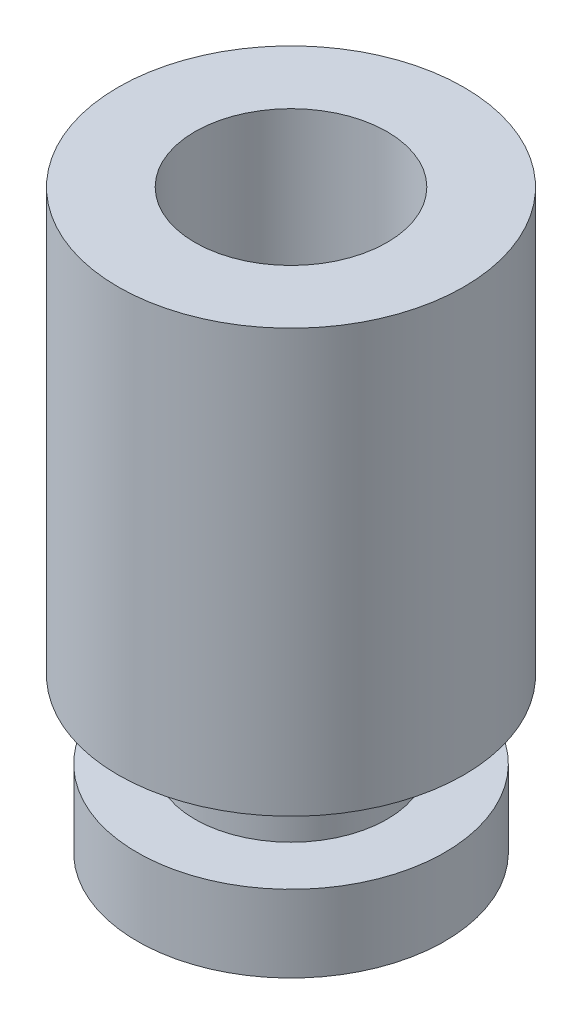
ISO-10303-21;
HEADER;
FILE_DESCRIPTION(('STEP AP214'),'2;1');
FILE_NAME('part.step','',(''),(''),'','','');
FILE_SCHEMA(('AUTOMOTIVE_DESIGN { 1 0 10303 214 1 1 1 1 }'));
ENDSEC;
DATA;
#1=APPLICATION_CONTEXT('core data for automotive mechanical design processes');
#2=APPLICATION_PROTOCOL_DEFINITION('international standard','automotive_design',2000,#1);
#3=PRODUCT_CONTEXT('',#1,'mechanical');
#4=PRODUCT('Part','Part','',(#3));
#5=PRODUCT_RELATED_PRODUCT_CATEGORY('part','',(#4));
#6=PRODUCT_DEFINITION_FORMATION('','',#4);
#7=PRODUCT_DEFINITION_CONTEXT('part definition',#1,'design');
#8=PRODUCT_DEFINITION('design','',#6,#7);
#9=PRODUCT_DEFINITION_SHAPE('','',#8);
#10=(LENGTH_UNIT() NAMED_UNIT(*) SI_UNIT(.MILLI.,.METRE.));
#11=(NAMED_UNIT(*) PLANE_ANGLE_UNIT() SI_UNIT($,.RADIAN.));
#12=(NAMED_UNIT(*) SI_UNIT($,.STERADIAN.) SOLID_ANGLE_UNIT());
#13=UNCERTAINTY_MEASURE_WITH_UNIT(LENGTH_MEASURE(1.E-05),#10,'distance_accuracy_value','');
#14=(GEOMETRIC_REPRESENTATION_CONTEXT(3) GLOBAL_UNCERTAINTY_ASSIGNED_CONTEXT((#13)) GLOBAL_UNIT_ASSIGNED_CONTEXT((#10,
#11,#12)) REPRESENTATION_CONTEXT('',''));
#15=CARTESIAN_POINT('',(0.,0.,0.));
#16=DIRECTION('',(0.,0.,1.));
#17=DIRECTION('',(1.,0.,0.));
#18=AXIS2_PLACEMENT_3D('',#15,#16,#17);
#19=CARTESIAN_POINT('',(-0.522013311509166,5.5,-0.51113803418606));
#20=DIRECTION('',(0.,-1.,0.));
#21=DIRECTION('',(0.,0.,-1.));
#22=AXIS2_PLACEMENT_3D('',#19,#20,#21);
#23=CYLINDRICAL_SURFACE('',#22,2.25);
#24=CARTESIAN_POINT('',(-0.522013311509166,5.5,-0.51113803418606));
#25=DIRECTION('',(0.,1.,0.));
#26=DIRECTION('',(0.,0.,1.));
#27=AXIS2_PLACEMENT_3D('',#24,#25,#26);
#28=CIRCLE('',#27,2.25);
#29=CARTESIAN_POINT('',(-0.522013311509166,5.5,1.73886196581394));
#30=VERTEX_POINT('',#29);
#31=EDGE_CURVE('E53',#30,#30,#28,.T.);
#32=ORIENTED_EDGE('',*,*,#31,.F.);
#33=EDGE_LOOP('',(#32));
#34=FACE_BOUND('',#33,.T.);
#35=CARTESIAN_POINT('',(-0.522013311509166,0.,-0.51113803418606));
#36=DIRECTION('',(0.,1.,0.));
#37=DIRECTION('',(0.,0.,1.));
#38=AXIS2_PLACEMENT_3D('',#35,#36,#37);
#39=CIRCLE('',#38,2.25);
#40=CARTESIAN_POINT('',(-0.522013311509166,0.,1.73886196581394));
#41=VERTEX_POINT('',#40);
#42=EDGE_CURVE('E48',#41,#41,#39,.T.);
#43=ORIENTED_EDGE('',*,*,#42,.T.);
#44=EDGE_LOOP('',(#43));
#45=FACE_BOUND('',#44,.T.);
#46=ADVANCED_FACE('F45',(#34,#45),#23,.T.);
#47=CARTESIAN_POINT('',(-0.522013311509166,5.5,-0.51113803418606));
#48=DIRECTION('',(0.,1.,0.));
#49=DIRECTION('',(0.,0.,1.));
#50=AXIS2_PLACEMENT_3D('',#47,#48,#49);
#51=PLANE('',#50);
#52=CARTESIAN_POINT('',(-0.522013311509166,5.5,-0.51113803418606));
#53=DIRECTION('',(0.,1.,0.));
#54=DIRECTION('',(0.,0.,1.));
#55=AXIS2_PLACEMENT_3D('',#52,#53,#54);
#56=CIRCLE('',#55,1.25);
#57=CARTESIAN_POINT('',(-0.522013311509166,5.5,0.73886196581394));
#58=VERTEX_POINT('',#57);
#59=EDGE_CURVE('E73',#58,#58,#56,.T.);
#60=ORIENTED_EDGE('',*,*,#59,.F.);
#61=EDGE_LOOP('',(#60));
#62=FACE_BOUND('',#61,.T.);
#63=ORIENTED_EDGE('',*,*,#31,.T.);
#64=EDGE_LOOP('',(#63));
#65=FACE_BOUND('',#64,.T.);
#66=ADVANCED_FACE('F90',(#62,#65),#51,.T.);
#67=CARTESIAN_POINT('',(-0.522013311509166,0.,-0.51113803418606));
#68=DIRECTION('',(0.,1.,0.));
#69=DIRECTION('',(0.,0.,1.));
#70=AXIS2_PLACEMENT_3D('',#67,#68,#69);
#71=PLANE('',#70);
#72=CARTESIAN_POINT('',(-0.522013311509166,0.,-0.51113803418606));
#73=DIRECTION('',(0.,-1.,0.));
#74=DIRECTION('',(0.,0.,-1.));
#75=AXIS2_PLACEMENT_3D('',#72,#73,#74);
#76=CIRCLE('',#75,1.25);
#77=CARTESIAN_POINT('',(-0.522013311509166,0.,-1.76113803418606));
#78=VERTEX_POINT('',#77);
#79=EDGE_CURVE('E10',#78,#78,#76,.T.);
#80=ORIENTED_EDGE('',*,*,#79,.F.);
#81=EDGE_LOOP('',(#80));
#82=FACE_BOUND('',#81,.T.);
#83=ORIENTED_EDGE('',*,*,#42,.F.);
#84=EDGE_LOOP('',(#83));
#85=FACE_BOUND('',#84,.T.);
#86=ADVANCED_FACE('F93',(#82,#85),#71,.F.);
#87=CARTESIAN_POINT('',(-0.522013311509166,-1.,-0.51113803418606));
#88=DIRECTION('',(0.,1.,0.));
#89=DIRECTION('',(0.,0.,1.));
#90=AXIS2_PLACEMENT_3D('',#87,#88,#89);
#91=CYLINDRICAL_SURFACE('',#90,1.25);
#92=CARTESIAN_POINT('',(-0.522013311509166,-1.,-0.51113803418606));
#93=DIRECTION('',(0.,-1.,0.));
#94=DIRECTION('',(0.,0.,-1.));
#95=AXIS2_PLACEMENT_3D('',#92,#93,#94);
#96=CIRCLE('',#95,1.25);
#97=CARTESIAN_POINT('',(-0.522013311509166,-1.,-1.76113803418606));
#98=VERTEX_POINT('',#97);
#99=EDGE_CURVE('E60',#98,#98,#96,.T.);
#100=ORIENTED_EDGE('',*,*,#99,.F.);
#101=EDGE_LOOP('',(#100));
#102=FACE_BOUND('',#101,.T.);
#103=ORIENTED_EDGE('',*,*,#79,.T.);
#104=EDGE_LOOP('',(#103));
#105=FACE_BOUND('',#104,.T.);
#106=ADVANCED_FACE('F104',(#102,#105),#91,.T.);
#107=CARTESIAN_POINT('',(-0.522013311509166,-2.,-0.51113803418606));
#108=DIRECTION('',(0.,1.,0.));
#109=DIRECTION('',(0.,0.,1.));
#110=AXIS2_PLACEMENT_3D('',#107,#108,#109);
#111=CYLINDRICAL_SURFACE('',#110,2.);
#112=CARTESIAN_POINT('',(-0.522013311509166,-2.,-0.51113803418606));
#113=DIRECTION('',(0.,-1.,0.));
#114=DIRECTION('',(0.,0.,-1.));
#115=AXIS2_PLACEMENT_3D('',#112,#113,#114);
#116=CIRCLE('',#115,2.);
#117=CARTESIAN_POINT('',(-0.522013311509166,-2.,-2.51113803418606));
#118=VERTEX_POINT('',#117);
#119=EDGE_CURVE('E64',#118,#118,#116,.T.);
#120=ORIENTED_EDGE('',*,*,#119,.F.);
#121=EDGE_LOOP('',(#120));
#122=FACE_BOUND('',#121,.T.);
#123=CARTESIAN_POINT('',(-0.522013311509166,-1.,-0.51113803418606));
#124=DIRECTION('',(0.,-1.,0.));
#125=DIRECTION('',(0.,0.,-1.));
#126=AXIS2_PLACEMENT_3D('',#123,#124,#125);
#127=CIRCLE('',#126,2.);
#128=CARTESIAN_POINT('',(-0.522013311509166,-1.,-2.51113803418606));
#129=VERTEX_POINT('',#128);
#130=EDGE_CURVE('E65',#129,#129,#127,.T.);
#131=ORIENTED_EDGE('',*,*,#130,.T.);
#132=EDGE_LOOP('',(#131));
#133=FACE_BOUND('',#132,.T.);
#134=ADVANCED_FACE('F109',(#122,#133),#111,.T.);
#135=CARTESIAN_POINT('',(-0.522013311509166,-2.,-0.51113803418606));
#136=DIRECTION('',(0.,-1.,0.));
#137=DIRECTION('',(0.,0.,-1.));
#138=AXIS2_PLACEMENT_3D('',#135,#136,#137);
#139=PLANE('',#138);
#140=ORIENTED_EDGE('',*,*,#119,.T.);
#141=EDGE_LOOP('',(#140));
#142=FACE_BOUND('',#141,.T.);
#143=ADVANCED_FACE('F115',(#142),#139,.T.);
#144=CARTESIAN_POINT('',(-0.522013311509166,-1.,-0.51113803418606));
#145=DIRECTION('',(0.,-1.,0.));
#146=DIRECTION('',(0.,0.,-1.));
#147=AXIS2_PLACEMENT_3D('',#144,#145,#146);
#148=PLANE('',#147);
#149=ORIENTED_EDGE('',*,*,#99,.T.);
#150=EDGE_LOOP('',(#149));
#151=FACE_BOUND('',#150,.T.);
#152=ORIENTED_EDGE('',*,*,#130,.F.);
#153=EDGE_LOOP('',(#152));
#154=FACE_BOUND('',#153,.T.);
#155=ADVANCED_FACE('F86',(#151,#154),#148,.F.);
#156=CARTESIAN_POINT('',(-0.522013311509166,0.5,-0.51113803418606));
#157=DIRECTION('',(0.,1.,0.));
#158=DIRECTION('',(0.,0.,1.));
#159=AXIS2_PLACEMENT_3D('',#156,#157,#158);
#160=CYLINDRICAL_SURFACE('',#159,1.25);
#161=CARTESIAN_POINT('',(-0.522013311509166,0.5,-0.51113803418606));
#162=DIRECTION('',(0.,1.,0.));
#163=DIRECTION('',(0.,0.,1.));
#164=AXIS2_PLACEMENT_3D('',#161,#162,#163);
#165=CIRCLE('',#164,1.25);
#166=CARTESIAN_POINT('',(-0.522013311509166,0.5,0.73886196581394));
#167=VERTEX_POINT('',#166);
#168=EDGE_CURVE('E69',#167,#167,#165,.T.);
#169=ORIENTED_EDGE('',*,*,#168,.F.);
#170=EDGE_LOOP('',(#169));
#171=FACE_BOUND('',#170,.T.);
#172=ORIENTED_EDGE('',*,*,#59,.T.);
#173=EDGE_LOOP('',(#172));
#174=FACE_BOUND('',#173,.T.);
#175=ADVANCED_FACE('F83',(#171,#174),#160,.F.);
#176=CARTESIAN_POINT('',(-0.522013311509166,0.5,-0.51113803418606));
#177=DIRECTION('',(0.,1.,0.));
#178=DIRECTION('',(0.,0.,1.));
#179=AXIS2_PLACEMENT_3D('',#176,#177,#178);
#180=PLANE('',#179);
#181=ORIENTED_EDGE('',*,*,#168,.T.);
#182=EDGE_LOOP('',(#181));
#183=FACE_BOUND('',#182,.T.);
#184=ADVANCED_FACE('F81',(#183),#180,.T.);
#185=CLOSED_SHELL('',(#46,#66,#86,#106,#134,#143,#155,#175,#184));
#186=MANIFOLD_SOLID_BREP('B2',#185);
#187=ADVANCED_BREP_SHAPE_REPRESENTATION('',(#18,#186),#14);
#188=SHAPE_DEFINITION_REPRESENTATION(#9,#187);
ENDSEC;
END-ISO-10303-21;
